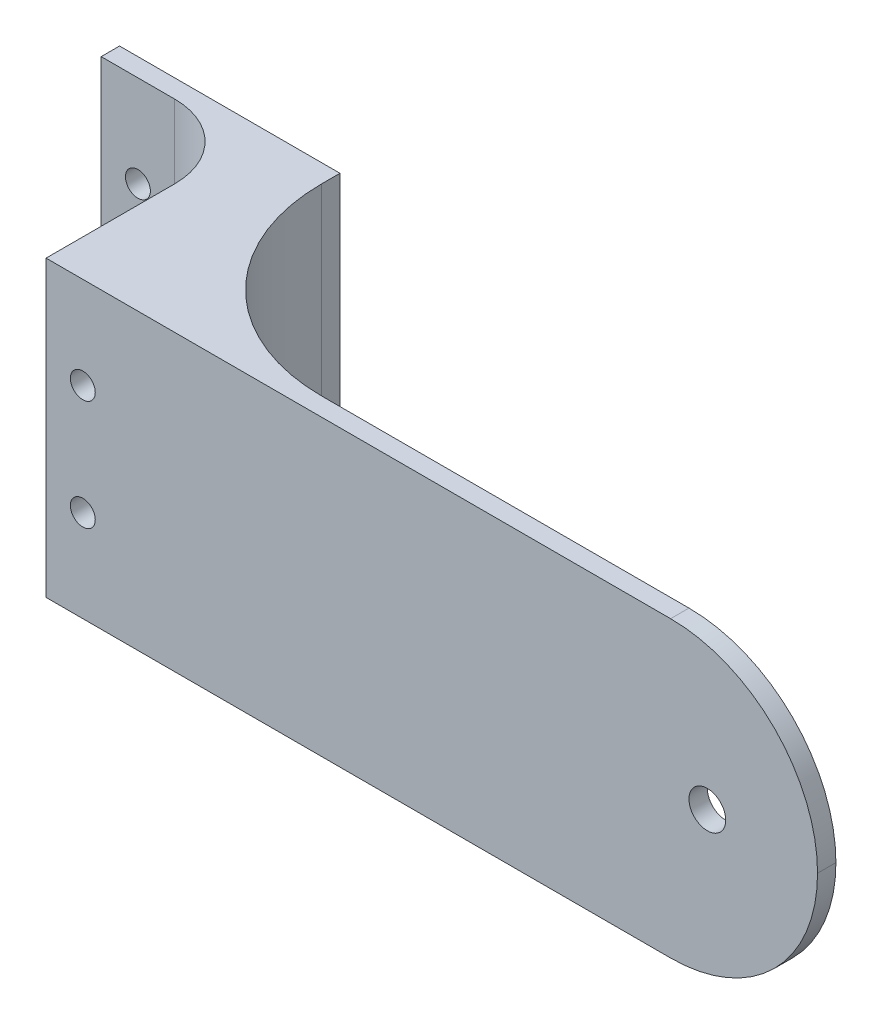
ISO-10303-21;
HEADER;
FILE_DESCRIPTION(('STEP AP214'),'2;1');
FILE_NAME('part.step','',(''),(''),'','','');
FILE_SCHEMA(('AUTOMOTIVE_DESIGN { 1 0 10303 214 1 1 1 1 }'));
ENDSEC;
DATA;
#1=APPLICATION_CONTEXT('core data for automotive mechanical design processes');
#2=APPLICATION_PROTOCOL_DEFINITION('international standard','automotive_design',2000,#1);
#3=PRODUCT_CONTEXT('',#1,'mechanical');
#4=PRODUCT('Part','Part','',(#3));
#5=PRODUCT_RELATED_PRODUCT_CATEGORY('part','',(#4));
#6=PRODUCT_DEFINITION_FORMATION('','',#4);
#7=PRODUCT_DEFINITION_CONTEXT('part definition',#1,'design');
#8=PRODUCT_DEFINITION('design','',#6,#7);
#9=PRODUCT_DEFINITION_SHAPE('','',#8);
#10=(LENGTH_UNIT() NAMED_UNIT(*) SI_UNIT(.MILLI.,.METRE.));
#11=(NAMED_UNIT(*) PLANE_ANGLE_UNIT() SI_UNIT($,.RADIAN.));
#12=(NAMED_UNIT(*) SI_UNIT($,.STERADIAN.) SOLID_ANGLE_UNIT());
#13=UNCERTAINTY_MEASURE_WITH_UNIT(LENGTH_MEASURE(1.E-05),#10,'distance_accuracy_value','');
#14=(GEOMETRIC_REPRESENTATION_CONTEXT(3) GLOBAL_UNCERTAINTY_ASSIGNED_CONTEXT((#13)) GLOBAL_UNIT_ASSIGNED_CONTEXT((#10,
#11,#12)) REPRESENTATION_CONTEXT('',''));
#15=CARTESIAN_POINT('',(0.,0.,0.));
#16=DIRECTION('',(0.,0.,1.));
#17=DIRECTION('',(1.,0.,0.));
#18=AXIS2_PLACEMENT_3D('',#15,#16,#17);
#19=CARTESIAN_POINT('',(0.,0.,19.05));
#20=DIRECTION('',(0.,0.,1.));
#21=DIRECTION('',(1.,0.,0.));
#22=AXIS2_PLACEMENT_3D('',#19,#20,#21);
#23=PLANE('',#22);
#24=CARTESIAN_POINT('',(-31.75,9.52500000000002,19.05));
#25=DIRECTION('',(0.,0.,1.));
#26=DIRECTION('',(1.,0.,0.));
#27=AXIS2_PLACEMENT_3D('',#24,#25,#26);
#28=CIRCLE('',#27,2.15265);
#29=CARTESIAN_POINT('',(-29.59735,9.52500000000002,19.05));
#30=VERTEX_POINT('',#29);
#31=EDGE_CURVE('E141',#30,#30,#28,.T.);
#32=ORIENTED_EDGE('',*,*,#31,.F.);
#33=EDGE_LOOP('',(#32));
#34=FACE_BOUND('',#33,.T.);
#35=CARTESIAN_POINT('',(-31.75,-9.52500000000003,19.05));
#36=DIRECTION('',(0.,0.,1.));
#37=DIRECTION('',(1.,0.,0.));
#38=AXIS2_PLACEMENT_3D('',#35,#36,#37);
#39=CIRCLE('',#38,2.15265);
#40=CARTESIAN_POINT('',(-29.59735,-9.52500000000003,19.05));
#41=VERTEX_POINT('',#40);
#42=EDGE_CURVE('E235',#41,#41,#39,.T.);
#43=ORIENTED_EDGE('',*,*,#42,.F.);
#44=EDGE_LOOP('',(#43));
#45=FACE_BOUND('',#44,.T.);
#46=DIRECTION('',(1.,0.,0.));
#47=VECTOR('',#46,1.);
#48=CARTESIAN_POINT('',(-38.1,-25.4,19.05));
#49=LINE('',#48,#47);
#50=CARTESIAN_POINT('',(-38.1,-25.4,19.05));
#51=VERTEX_POINT('',#50);
#52=CARTESIAN_POINT('',(-25.4,-25.4,19.05));
#53=VERTEX_POINT('',#52);
#54=EDGE_CURVE('E150',#51,#53,#49,.T.);
#55=ORIENTED_EDGE('',*,*,#54,.T.);
#56=DIRECTION('',(0.,1.,0.));
#57=VECTOR('',#56,1.);
#58=CARTESIAN_POINT('',(-25.4,25.4,19.05));
#59=LINE('',#58,#57);
#60=CARTESIAN_POINT('',(-25.4,25.4,19.05));
#61=VERTEX_POINT('',#60);
#62=EDGE_CURVE('E172',#53,#61,#59,.T.);
#63=ORIENTED_EDGE('',*,*,#62,.T.);
#64=DIRECTION('',(-1.,0.,0.));
#65=VECTOR('',#64,1.);
#66=CARTESIAN_POINT('',(0.,25.4,19.05));
#67=LINE('',#66,#65);
#68=CARTESIAN_POINT('',(-38.1,25.4,19.05));
#69=VERTEX_POINT('',#68);
#70=EDGE_CURVE('E145',#61,#69,#67,.T.);
#71=ORIENTED_EDGE('',*,*,#70,.T.);
#72=DIRECTION('',(0.,-1.,0.));
#73=VECTOR('',#72,1.);
#74=CARTESIAN_POINT('',(-38.1,25.4,19.05));
#75=LINE('',#74,#73);
#76=EDGE_CURVE('E147',#69,#51,#75,.T.);
#77=ORIENTED_EDGE('',*,*,#76,.T.);
#78=EDGE_LOOP('',(#55,#63,#71,#77));
#79=FACE_BOUND('',#78,.T.);
#80=ADVANCED_FACE('F34',(#34,#45,#79),#23,.T.);
#81=CARTESIAN_POINT('',(0.,-25.4,19.05));
#82=DIRECTION('',(-1.,0.,0.));
#83=DIRECTION('',(0.,-1.,0.));
#84=AXIS2_PLACEMENT_3D('',#81,#82,#83);
#85=PLANE('',#84);
#86=DIRECTION('',(0.,0.,-1.));
#87=VECTOR('',#86,1.);
#88=CARTESIAN_POINT('',(0.,25.4,19.05));
#89=LINE('',#88,#87);
#90=CARTESIAN_POINT('',(0.,25.4,19.05));
#91=VERTEX_POINT('',#90);
#92=CARTESIAN_POINT('',(0.,25.4,15.875));
#93=VERTEX_POINT('',#92);
#94=EDGE_CURVE('E170',#91,#93,#89,.T.);
#95=ORIENTED_EDGE('',*,*,#94,.F.);
#96=DIRECTION('',(0.,1.,0.));
#97=VECTOR('',#96,1.);
#98=CARTESIAN_POINT('',(0.,-25.4,19.05));
#99=LINE('',#98,#97);
#100=CARTESIAN_POINT('',(0.,-25.4,19.05));
#101=VERTEX_POINT('',#100);
#102=EDGE_CURVE('E183',#91,#101,#99,.F.);
#103=ORIENTED_EDGE('',*,*,#102,.T.);
#104=DIRECTION('',(0.,0.,-1.));
#105=VECTOR('',#104,1.);
#106=CARTESIAN_POINT('',(0.,-25.4,19.05));
#107=LINE('',#106,#105);
#108=CARTESIAN_POINT('',(0.,-25.4,15.875));
#109=VERTEX_POINT('',#108);
#110=EDGE_CURVE('E153',#101,#109,#107,.T.);
#111=ORIENTED_EDGE('',*,*,#110,.T.);
#112=DIRECTION('',(0.,1.,0.));
#113=VECTOR('',#112,1.);
#114=CARTESIAN_POINT('',(0.,-25.4,15.875));
#115=LINE('',#114,#113);
#116=EDGE_CURVE('E143',#109,#93,#115,.T.);
#117=ORIENTED_EDGE('',*,*,#116,.T.);
#118=EDGE_LOOP('',(#95,#103,#111,#117));
#119=FACE_BOUND('',#118,.T.);
#120=ADVANCED_FACE('F245',(#119),#85,.F.);
#121=CARTESIAN_POINT('',(0.,25.4,19.05));
#122=DIRECTION('',(0.,-1.,0.));
#123=DIRECTION('',(0.,0.,-1.));
#124=AXIS2_PLACEMENT_3D('',#121,#122,#123);
#125=PLANE('',#124);
#126=DIRECTION('',(-1.,0.,0.));
#127=VECTOR('',#126,1.);
#128=CARTESIAN_POINT('',(-12.7,25.4,53.975));
#129=LINE('',#128,#127);
#130=CARTESIAN_POINT('',(95.25,25.4,53.975));
#131=VERTEX_POINT('',#130);
#132=CARTESIAN_POINT('',(-12.7,25.4,53.975));
#133=VERTEX_POINT('',#132);
#134=EDGE_CURVE('E112',#131,#133,#129,.T.);
#135=ORIENTED_EDGE('',*,*,#134,.F.);
#136=DIRECTION('',(0.,0.,-1.));
#137=VECTOR('',#136,1.);
#138=CARTESIAN_POINT('',(95.25,25.4,19.05));
#139=LINE('',#138,#137);
#140=CARTESIAN_POINT('',(95.25,25.4,50.8));
#141=VERTEX_POINT('',#140);
#142=EDGE_CURVE('E12',#131,#141,#139,.T.);
#143=ORIENTED_EDGE('',*,*,#142,.T.);
#144=DIRECTION('',(-1.,0.,0.));
#145=VECTOR('',#144,1.);
#146=CARTESIAN_POINT('',(0.,25.4,50.8));
#147=LINE('',#146,#145);
#148=CARTESIAN_POINT('',(31.75,25.4,50.8));
#149=VERTEX_POINT('',#148);
#150=EDGE_CURVE('E120',#141,#149,#147,.T.);
#151=ORIENTED_EDGE('',*,*,#150,.T.);
#152=CARTESIAN_POINT('',(31.75,25.4,19.05));
#153=DIRECTION('',(0.,-1.,0.));
#154=DIRECTION('',(0.,0.,-1.));
#155=AXIS2_PLACEMENT_3D('',#152,#153,#154);
#156=CIRCLE('',#155,31.75);
#157=EDGE_CURVE('E185',#149,#91,#156,.T.);
#158=ORIENTED_EDGE('',*,*,#157,.T.);
#159=ORIENTED_EDGE('',*,*,#94,.T.);
#160=DIRECTION('',(-1.,0.,0.));
#161=VECTOR('',#160,1.);
#162=CARTESIAN_POINT('',(0.,25.4,15.875));
#163=LINE('',#162,#161);
#164=CARTESIAN_POINT('',(-38.1,25.4,15.875));
#165=VERTEX_POINT('',#164);
#166=EDGE_CURVE('E156',#93,#165,#163,.T.);
#167=ORIENTED_EDGE('',*,*,#166,.T.);
#168=DIRECTION('',(0.,0.,-1.));
#169=VECTOR('',#168,1.);
#170=CARTESIAN_POINT('',(-38.1,25.4,19.05));
#171=LINE('',#170,#169);
#172=EDGE_CURVE('E167',#69,#165,#171,.T.);
#173=ORIENTED_EDGE('',*,*,#172,.F.);
#174=ORIENTED_EDGE('',*,*,#70,.F.);
#175=CARTESIAN_POINT('',(-25.4,25.4,31.75));
#176=DIRECTION('',(0.,-1.,0.));
#177=DIRECTION('',(0.,0.,-1.));
#178=AXIS2_PLACEMENT_3D('',#175,#176,#177);
#179=CIRCLE('',#178,12.7);
#180=CARTESIAN_POINT('',(-12.7,25.4,31.75));
#181=VERTEX_POINT('',#180);
#182=EDGE_CURVE('E126',#61,#181,#179,.T.);
#183=ORIENTED_EDGE('',*,*,#182,.T.);
#184=DIRECTION('',(0.,0.,1.));
#185=VECTOR('',#184,1.);
#186=CARTESIAN_POINT('',(-12.7,25.4,-33.3134414453443));
#187=LINE('',#186,#185);
#188=EDGE_CURVE('E123',#181,#133,#187,.T.);
#189=ORIENTED_EDGE('',*,*,#188,.T.);
#190=EDGE_LOOP('',(#135,#143,#151,#158,#159,#167,#173,#174,#183,#189));
#191=FACE_BOUND('',#190,.T.);
#192=ADVANCED_FACE('F124',(#191),#125,.F.);
#193=CARTESIAN_POINT('',(-38.1,25.4,19.05));
#194=DIRECTION('',(1.,0.,0.));
#195=DIRECTION('',(0.,1.,0.));
#196=AXIS2_PLACEMENT_3D('',#193,#194,#195);
#197=PLANE('',#196);
#198=DIRECTION('',(0.,-1.,0.));
#199=VECTOR('',#198,1.);
#200=CARTESIAN_POINT('',(-38.1,25.4,15.875));
#201=LINE('',#200,#199);
#202=CARTESIAN_POINT('',(-38.1,-25.4,15.875));
#203=VERTEX_POINT('',#202);
#204=EDGE_CURVE('E158',#165,#203,#201,.T.);
#205=ORIENTED_EDGE('',*,*,#204,.T.);
#206=DIRECTION('',(0.,0.,-1.));
#207=VECTOR('',#206,1.);
#208=CARTESIAN_POINT('',(-38.1,-25.4,19.05));
#209=LINE('',#208,#207);
#210=EDGE_CURVE('E164',#51,#203,#209,.T.);
#211=ORIENTED_EDGE('',*,*,#210,.F.);
#212=ORIENTED_EDGE('',*,*,#76,.F.);
#213=ORIENTED_EDGE('',*,*,#172,.T.);
#214=EDGE_LOOP('',(#205,#211,#212,#213));
#215=FACE_BOUND('',#214,.T.);
#216=ADVANCED_FACE('F302',(#215),#197,.F.);
#217=CARTESIAN_POINT('',(-25.4,-25.4,19.05));
#218=DIRECTION('',(0.,1.,0.));
#219=DIRECTION('',(-1.,0.,0.));
#220=AXIS2_PLACEMENT_3D('',#217,#218,#219);
#221=PLANE('',#220);
#222=DIRECTION('',(1.,0.,0.));
#223=VECTOR('',#222,1.);
#224=CARTESIAN_POINT('',(120.65,-25.4,50.8));
#225=LINE('',#224,#223);
#226=CARTESIAN_POINT('',(31.75,-25.4,50.8));
#227=VERTEX_POINT('',#226);
#228=CARTESIAN_POINT('',(95.25,-25.4,50.8));
#229=VERTEX_POINT('',#228);
#230=EDGE_CURVE('E138',#227,#229,#225,.T.);
#231=ORIENTED_EDGE('',*,*,#230,.T.);
#232=DIRECTION('',(0.,0.,-1.));
#233=VECTOR('',#232,1.);
#234=CARTESIAN_POINT('',(95.25,-25.4,19.05));
#235=LINE('',#234,#233);
#236=CARTESIAN_POINT('',(95.25,-25.3999999999999,53.975));
#237=VERTEX_POINT('',#236);
#238=EDGE_CURVE('E193',#229,#237,#235,.F.);
#239=ORIENTED_EDGE('',*,*,#238,.T.);
#240=DIRECTION('',(1.,0.,0.));
#241=VECTOR('',#240,1.);
#242=CARTESIAN_POINT('',(0.,-25.4,53.975));
#243=LINE('',#242,#241);
#244=CARTESIAN_POINT('',(-12.7,-25.4,53.975));
#245=VERTEX_POINT('',#244);
#246=EDGE_CURVE('E130',#245,#237,#243,.T.);
#247=ORIENTED_EDGE('',*,*,#246,.F.);
#248=DIRECTION('',(0.,0.,1.));
#249=VECTOR('',#248,1.);
#250=CARTESIAN_POINT('',(-12.7,-25.4,-33.3134414453443));
#251=LINE('',#250,#249);
#252=CARTESIAN_POINT('',(-12.7,-25.4,31.75));
#253=VERTEX_POINT('',#252);
#254=EDGE_CURVE('E129',#253,#245,#251,.T.);
#255=ORIENTED_EDGE('',*,*,#254,.F.);
#256=CARTESIAN_POINT('',(-25.4,-25.4,31.75));
#257=DIRECTION('',(0.,1.,0.));
#258=DIRECTION('',(-1.,0.,0.));
#259=AXIS2_PLACEMENT_3D('',#256,#257,#258);
#260=CIRCLE('',#259,12.7);
#261=EDGE_CURVE('E178',#253,#53,#260,.T.);
#262=ORIENTED_EDGE('',*,*,#261,.T.);
#263=ORIENTED_EDGE('',*,*,#54,.F.);
#264=ORIENTED_EDGE('',*,*,#210,.T.);
#265=DIRECTION('',(1.,0.,0.));
#266=VECTOR('',#265,1.);
#267=CARTESIAN_POINT('',(-25.4,-25.4,15.875));
#268=LINE('',#267,#266);
#269=EDGE_CURVE('E148',#203,#109,#268,.T.);
#270=ORIENTED_EDGE('',*,*,#269,.T.);
#271=ORIENTED_EDGE('',*,*,#110,.F.);
#272=CARTESIAN_POINT('',(31.75,-25.4,19.05));
#273=DIRECTION('',(0.,1.,0.));
#274=DIRECTION('',(-1.,0.,0.));
#275=AXIS2_PLACEMENT_3D('',#272,#273,#274);
#276=CIRCLE('',#275,31.75);
#277=EDGE_CURVE('E187',#101,#227,#276,.T.);
#278=ORIENTED_EDGE('',*,*,#277,.T.);
#279=EDGE_LOOP('',(#231,#239,#247,#255,#262,#263,#264,#270,#271,#278));
#280=FACE_BOUND('',#279,.T.);
#281=ADVANCED_FACE('F199',(#280),#221,.F.);
#282=CARTESIAN_POINT('',(0.,0.,15.875));
#283=DIRECTION('',(0.,0.,1.));
#284=DIRECTION('',(1.,0.,0.));
#285=AXIS2_PLACEMENT_3D('',#282,#283,#284);
#286=PLANE('',#285);
#287=CARTESIAN_POINT('',(-31.75,9.52500000000002,15.875));
#288=DIRECTION('',(0.,0.,1.));
#289=DIRECTION('',(1.,0.,0.));
#290=AXIS2_PLACEMENT_3D('',#287,#288,#289);
#291=CIRCLE('',#290,2.15265);
#292=CARTESIAN_POINT('',(-29.59735,9.52500000000002,15.875));
#293=VERTEX_POINT('',#292);
#294=EDGE_CURVE('E221',#293,#293,#291,.F.);
#295=ORIENTED_EDGE('',*,*,#294,.F.);
#296=EDGE_LOOP('',(#295));
#297=FACE_BOUND('',#296,.T.);
#298=CARTESIAN_POINT('',(-6.34999999999999,-9.52500000000002,15.875));
#299=DIRECTION('',(0.,0.,1.));
#300=DIRECTION('',(1.,0.,0.));
#301=AXIS2_PLACEMENT_3D('',#298,#299,#300);
#302=CIRCLE('',#301,2.15265);
#303=CARTESIAN_POINT('',(-4.19734999999999,-9.52500000000002,15.875));
#304=VERTEX_POINT('',#303);
#305=EDGE_CURVE('E225',#304,#304,#302,.F.);
#306=ORIENTED_EDGE('',*,*,#305,.F.);
#307=EDGE_LOOP('',(#306));
#308=FACE_BOUND('',#307,.T.);
#309=CARTESIAN_POINT('',(-31.75,-9.52500000000003,15.875));
#310=DIRECTION('',(0.,0.,1.));
#311=DIRECTION('',(1.,0.,0.));
#312=AXIS2_PLACEMENT_3D('',#309,#310,#311);
#313=CIRCLE('',#312,2.15265);
#314=CARTESIAN_POINT('',(-29.59735,-9.52500000000003,15.875));
#315=VERTEX_POINT('',#314);
#316=EDGE_CURVE('E208',#315,#315,#313,.F.);
#317=ORIENTED_EDGE('',*,*,#316,.F.);
#318=EDGE_LOOP('',(#317));
#319=FACE_BOUND('',#318,.T.);
#320=CARTESIAN_POINT('',(-6.34999999999999,9.52500000000002,15.875));
#321=DIRECTION('',(0.,0.,1.));
#322=DIRECTION('',(1.,0.,0.));
#323=AXIS2_PLACEMENT_3D('',#320,#321,#322);
#324=CIRCLE('',#323,2.15265);
#325=CARTESIAN_POINT('',(-4.19734999999999,9.52500000000002,15.875));
#326=VERTEX_POINT('',#325);
#327=EDGE_CURVE('E232',#326,#326,#324,.F.);
#328=ORIENTED_EDGE('',*,*,#327,.F.);
#329=EDGE_LOOP('',(#328));
#330=FACE_BOUND('',#329,.T.);
#331=ORIENTED_EDGE('',*,*,#116,.F.);
#332=ORIENTED_EDGE('',*,*,#269,.F.);
#333=ORIENTED_EDGE('',*,*,#204,.F.);
#334=ORIENTED_EDGE('',*,*,#166,.F.);
#335=EDGE_LOOP('',(#331,#332,#333,#334));
#336=FACE_BOUND('',#335,.T.);
#337=ADVANCED_FACE('F265',(#297,#308,#319,#330,#336),#286,.F.);
#338=CARTESIAN_POINT('',(-12.7,25.4,-33.3134414453443));
#339=DIRECTION('',(-1.,0.,0.));
#340=DIRECTION('',(0.,-1.,0.));
#341=AXIS2_PLACEMENT_3D('',#338,#339,#340);
#342=PLANE('',#341);
#343=ORIENTED_EDGE('',*,*,#188,.F.);
#344=DIRECTION('',(0.,1.,0.));
#345=VECTOR('',#344,1.);
#346=CARTESIAN_POINT('',(-12.7,-25.4,31.75));
#347=LINE('',#346,#345);
#348=EDGE_CURVE('E175',#181,#253,#347,.F.);
#349=ORIENTED_EDGE('',*,*,#348,.T.);
#350=ORIENTED_EDGE('',*,*,#254,.T.);
#351=DIRECTION('',(0.,-1.,0.));
#352=VECTOR('',#351,1.);
#353=CARTESIAN_POINT('',(-12.7,-25.4,53.975));
#354=LINE('',#353,#352);
#355=EDGE_CURVE('E116',#133,#245,#354,.T.);
#356=ORIENTED_EDGE('',*,*,#355,.F.);
#357=EDGE_LOOP('',(#343,#349,#350,#356));
#358=FACE_BOUND('',#357,.T.);
#359=ADVANCED_FACE('F132',(#358),#342,.T.);
#360=CARTESIAN_POINT('',(-25.4,0.,31.75));
#361=DIRECTION('',(0.,-1.,0.));
#362=DIRECTION('',(1.,0.,0.));
#363=AXIS2_PLACEMENT_3D('',#360,#361,#362);
#364=CYLINDRICAL_SURFACE('',#363,12.7);
#365=ORIENTED_EDGE('',*,*,#261,.F.);
#366=ORIENTED_EDGE('',*,*,#348,.F.);
#367=ORIENTED_EDGE('',*,*,#182,.F.);
#368=ORIENTED_EDGE('',*,*,#62,.F.);
#369=EDGE_LOOP('',(#365,#366,#367,#368));
#370=FACE_BOUND('',#369,.T.);
#371=ADVANCED_FACE('F255',(#370),#364,.F.);
#372=CARTESIAN_POINT('',(0.,0.,53.975));
#373=DIRECTION('',(0.,0.,-1.));
#374=DIRECTION('',(-1.,0.,0.));
#375=AXIS2_PLACEMENT_3D('',#372,#373,#374);
#376=PLANE('',#375);
#377=CARTESIAN_POINT('',(101.6,0.,53.975));
#378=DIRECTION('',(0.,0.,1.));
#379=DIRECTION('',(1.,0.,0.));
#380=AXIS2_PLACEMENT_3D('',#377,#378,#379);
#381=CIRCLE('',#380,3.175);
#382=CARTESIAN_POINT('',(104.775,0.,53.975));
#383=VERTEX_POINT('',#382);
#384=EDGE_CURVE('E209',#383,#383,#381,.T.);
#385=ORIENTED_EDGE('',*,*,#384,.F.);
#386=EDGE_LOOP('',(#385));
#387=FACE_BOUND('',#386,.T.);
#388=CARTESIAN_POINT('',(-6.34999999999999,-9.52500000000002,53.975));
#389=DIRECTION('',(0.,0.,1.));
#390=DIRECTION('',(-1.,0.,0.));
#391=AXIS2_PLACEMENT_3D('',#388,#389,#390);
#392=CIRCLE('',#391,2.15265);
#393=CARTESIAN_POINT('',(-4.19734999999999,-9.52500000000002,53.975));
#394=VERTEX_POINT('',#393);
#395=EDGE_CURVE('E211',#394,#394,#392,.T.);
#396=ORIENTED_EDGE('',*,*,#395,.F.);
#397=EDGE_LOOP('',(#396));
#398=FACE_BOUND('',#397,.T.);
#399=CARTESIAN_POINT('',(-6.34999999999999,9.52500000000002,53.975));
#400=DIRECTION('',(0.,0.,1.));
#401=DIRECTION('',(1.,0.,0.));
#402=AXIS2_PLACEMENT_3D('',#399,#400,#401);
#403=CIRCLE('',#402,2.15265);
#404=CARTESIAN_POINT('',(-4.19734999999999,9.52500000000002,53.975));
#405=VERTEX_POINT('',#404);
#406=EDGE_CURVE('E224',#405,#405,#403,.T.);
#407=ORIENTED_EDGE('',*,*,#406,.F.);
#408=EDGE_LOOP('',(#407));
#409=FACE_BOUND('',#408,.T.);
#410=ORIENTED_EDGE('',*,*,#246,.T.);
#411=CARTESIAN_POINT('',(95.25,0.,53.975));
#412=DIRECTION('',(0.,0.,-1.));
#413=DIRECTION('',(-1.,0.,0.));
#414=AXIS2_PLACEMENT_3D('',#411,#412,#413);
#415=CIRCLE('',#414,25.4);
#416=CARTESIAN_POINT('',(120.65,0.,53.975));
#417=VERTEX_POINT('',#416);
#418=EDGE_CURVE('E43',#237,#417,#415,.F.);
#419=ORIENTED_EDGE('',*,*,#418,.T.);
#420=CARTESIAN_POINT('',(95.25,0.,53.975));
#421=DIRECTION('',(0.,0.,-1.));
#422=DIRECTION('',(-1.,0.,0.));
#423=AXIS2_PLACEMENT_3D('',#420,#421,#422);
#424=CIRCLE('',#423,25.4);
#425=EDGE_CURVE('E53',#417,#131,#424,.F.);
#426=ORIENTED_EDGE('',*,*,#425,.T.);
#427=ORIENTED_EDGE('',*,*,#134,.T.);
#428=ORIENTED_EDGE('',*,*,#355,.T.);
#429=EDGE_LOOP('',(#410,#419,#426,#427,#428));
#430=FACE_BOUND('',#429,.T.);
#431=ADVANCED_FACE('F114',(#387,#398,#409,#430),#376,.F.);
#432=CARTESIAN_POINT('',(0.,0.,50.8));
#433=DIRECTION('',(0.,0.,-1.));
#434=DIRECTION('',(-1.,0.,0.));
#435=AXIS2_PLACEMENT_3D('',#432,#433,#434);
#436=PLANE('',#435);
#437=CARTESIAN_POINT('',(101.6,0.,50.8));
#438=DIRECTION('',(0.,0.,-1.));
#439=DIRECTION('',(-1.,0.,0.));
#440=AXIS2_PLACEMENT_3D('',#437,#438,#439);
#441=CIRCLE('',#440,3.175);
#442=CARTESIAN_POINT('',(98.425,0.,50.8));
#443=VERTEX_POINT('',#442);
#444=EDGE_CURVE('E214',#443,#443,#441,.F.);
#445=ORIENTED_EDGE('',*,*,#444,.T.);
#446=EDGE_LOOP('',(#445));
#447=FACE_BOUND('',#446,.T.);
#448=CARTESIAN_POINT('',(95.25,0.,50.8));
#449=DIRECTION('',(0.,0.,-1.));
#450=DIRECTION('',(-1.,0.,0.));
#451=AXIS2_PLACEMENT_3D('',#448,#449,#450);
#452=CIRCLE('',#451,25.4);
#453=CARTESIAN_POINT('',(120.65,0.,50.8));
#454=VERTEX_POINT('',#453);
#455=EDGE_CURVE('E189',#141,#454,#452,.T.);
#456=ORIENTED_EDGE('',*,*,#455,.T.);
#457=CARTESIAN_POINT('',(95.25,0.,50.8));
#458=DIRECTION('',(0.,0.,-1.));
#459=DIRECTION('',(-1.,0.,0.));
#460=AXIS2_PLACEMENT_3D('',#457,#458,#459);
#461=CIRCLE('',#460,25.4);
#462=EDGE_CURVE('E191',#454,#229,#461,.T.);
#463=ORIENTED_EDGE('',*,*,#462,.T.);
#464=ORIENTED_EDGE('',*,*,#230,.F.);
#465=DIRECTION('',(0.,1.,0.));
#466=VECTOR('',#465,1.);
#467=CARTESIAN_POINT('',(31.75,0.,50.8));
#468=LINE('',#467,#466);
#469=EDGE_CURVE('E180',#227,#149,#468,.T.);
#470=ORIENTED_EDGE('',*,*,#469,.T.);
#471=ORIENTED_EDGE('',*,*,#150,.F.);
#472=EDGE_LOOP('',(#456,#463,#464,#470,#471));
#473=FACE_BOUND('',#472,.T.);
#474=ADVANCED_FACE('F262',(#447,#473),#436,.T.);
#475=CARTESIAN_POINT('',(31.75,0.,19.05));
#476=DIRECTION('',(0.,1.,0.));
#477=DIRECTION('',(-1.,0.,0.));
#478=AXIS2_PLACEMENT_3D('',#475,#476,#477);
#479=CYLINDRICAL_SURFACE('',#478,31.75);
#480=ORIENTED_EDGE('',*,*,#277,.F.);
#481=ORIENTED_EDGE('',*,*,#102,.F.);
#482=ORIENTED_EDGE('',*,*,#157,.F.);
#483=ORIENTED_EDGE('',*,*,#469,.F.);
#484=EDGE_LOOP('',(#480,#481,#482,#483));
#485=FACE_BOUND('',#484,.T.);
#486=ADVANCED_FACE('F270',(#485),#479,.F.);
#487=CARTESIAN_POINT('',(-6.34999999999999,9.52500000000002,9.78638634991511));
#488=DIRECTION('',(0.,0.,1.));
#489=DIRECTION('',(1.,0.,0.));
#490=AXIS2_PLACEMENT_3D('',#487,#488,#489);
#491=CYLINDRICAL_SURFACE('',#490,2.15265);
#492=CARTESIAN_POINT('',(-4.19734999999999,9.52500000000002,15.875));
#493=CARTESIAN_POINT('',(-4.19734999999999,9.52500000000002,16.271875));
#494=CARTESIAN_POINT('',(-4.19734999999999,9.52500000000002,16.66875));
#495=CARTESIAN_POINT('',(-4.19734999999999,9.52500000000002,17.4625));
#496=CARTESIAN_POINT('',(-4.19734999999999,9.52500000000002,17.859375));
#497=CARTESIAN_POINT('',(-4.19734999999999,9.52500000000002,18.653125));
#498=CARTESIAN_POINT('',(-4.19734999999999,9.52500000000002,19.05));
#499=CARTESIAN_POINT('',(-4.19734999999999,9.52500000000002,19.84375));
#500=CARTESIAN_POINT('',(-4.19734999999999,9.52500000000002,20.240625));
#501=CARTESIAN_POINT('',(-4.19734999999999,9.52500000000002,21.034375));
#502=CARTESIAN_POINT('',(-4.19734999999999,9.52500000000002,21.43125));
#503=CARTESIAN_POINT('',(-4.19734999999999,9.52500000000002,22.225));
#504=CARTESIAN_POINT('',(-4.19734999999999,9.52500000000002,22.621875));
#505=CARTESIAN_POINT('',(-4.19734999999999,9.52500000000002,23.415625));
#506=CARTESIAN_POINT('',(-4.19734999999999,9.52500000000002,23.8125));
#507=CARTESIAN_POINT('',(-4.19734999999999,9.52500000000002,24.60625));
#508=CARTESIAN_POINT('',(-4.19734999999999,9.52500000000002,25.003125));
#509=CARTESIAN_POINT('',(-4.19734999999999,9.52500000000002,25.796875));
#510=CARTESIAN_POINT('',(-4.19734999999999,9.52500000000002,26.19375));
#511=CARTESIAN_POINT('',(-4.19734999999999,9.52500000000002,26.9875));
#512=CARTESIAN_POINT('',(-4.19734999999999,9.52500000000002,27.384375));
#513=CARTESIAN_POINT('',(-4.19734999999999,9.52500000000002,28.178125));
#514=CARTESIAN_POINT('',(-4.19734999999999,9.52500000000002,28.575));
#515=CARTESIAN_POINT('',(-4.19734999999999,9.52500000000002,29.36875));
#516=CARTESIAN_POINT('',(-4.19734999999999,9.52500000000002,29.765625));
#517=CARTESIAN_POINT('',(-4.19734999999999,9.52500000000002,30.559375));
#518=CARTESIAN_POINT('',(-4.19734999999999,9.52500000000002,30.95625));
#519=CARTESIAN_POINT('',(-4.19734999999999,9.52500000000002,31.75));
#520=CARTESIAN_POINT('',(-4.19734999999999,9.52500000000002,32.146875));
#521=CARTESIAN_POINT('',(-4.19734999999999,9.52500000000002,32.940625));
#522=CARTESIAN_POINT('',(-4.19734999999999,9.52500000000002,33.3375));
#523=CARTESIAN_POINT('',(-4.19734999999999,9.52500000000002,34.13125));
#524=CARTESIAN_POINT('',(-4.19734999999999,9.52500000000002,34.528125));
#525=CARTESIAN_POINT('',(-4.19734999999999,9.52500000000002,35.321875));
#526=CARTESIAN_POINT('',(-4.19734999999999,9.52500000000002,35.71875));
#527=CARTESIAN_POINT('',(-4.19734999999999,9.52500000000002,36.5125));
#528=CARTESIAN_POINT('',(-4.19734999999999,9.52500000000002,36.909375));
#529=CARTESIAN_POINT('',(-4.19734999999999,9.52500000000002,37.703125));
#530=CARTESIAN_POINT('',(-4.19734999999999,9.52500000000002,38.1));
#531=CARTESIAN_POINT('',(-4.19734999999999,9.52500000000002,38.89375));
#532=CARTESIAN_POINT('',(-4.19734999999999,9.52500000000002,39.290625));
#533=CARTESIAN_POINT('',(-4.19734999999999,9.52500000000002,40.084375));
#534=CARTESIAN_POINT('',(-4.19734999999999,9.52500000000002,40.48125));
#535=CARTESIAN_POINT('',(-4.19734999999999,9.52500000000002,41.275));
#536=CARTESIAN_POINT('',(-4.19734999999999,9.52500000000002,41.671875));
#537=CARTESIAN_POINT('',(-4.19734999999999,9.52500000000002,42.465625));
#538=CARTESIAN_POINT('',(-4.19734999999999,9.52500000000002,42.8625));
#539=CARTESIAN_POINT('',(-4.19734999999999,9.52500000000002,43.65625));
#540=CARTESIAN_POINT('',(-4.19734999999999,9.52500000000002,44.053125));
#541=CARTESIAN_POINT('',(-4.19734999999999,9.52500000000002,44.846875));
#542=CARTESIAN_POINT('',(-4.19734999999999,9.52500000000002,45.24375));
#543=CARTESIAN_POINT('',(-4.19734999999999,9.52500000000002,46.0375));
#544=CARTESIAN_POINT('',(-4.19734999999999,9.52500000000002,46.434375));
#545=CARTESIAN_POINT('',(-4.19734999999999,9.52500000000002,47.228125));
#546=CARTESIAN_POINT('',(-4.19734999999999,9.52500000000002,47.625));
#547=CARTESIAN_POINT('',(-4.19734999999999,9.52500000000002,48.41875));
#548=CARTESIAN_POINT('',(-4.19734999999999,9.52500000000002,48.815625));
#549=CARTESIAN_POINT('',(-4.19734999999999,9.52500000000002,49.609375));
#550=CARTESIAN_POINT('',(-4.19734999999999,9.52500000000002,50.00625));
#551=CARTESIAN_POINT('',(-4.19734999999999,9.52500000000002,50.8));
#552=CARTESIAN_POINT('',(-4.19734999999999,9.52500000000002,51.196875));
#553=CARTESIAN_POINT('',(-4.19734999999999,9.52500000000002,51.990625));
#554=CARTESIAN_POINT('',(-4.19734999999999,9.52500000000002,52.3875));
#555=CARTESIAN_POINT('',(-4.19734999999999,9.52500000000002,53.18125));
#556=CARTESIAN_POINT('',(-4.19734999999999,9.52500000000002,53.578125));
#557=CARTESIAN_POINT('',(-4.19734999999999,9.52500000000002,53.975));
#558=B_SPLINE_CURVE_WITH_KNOTS('',3,(#492,#493,#494,#495,#496,#497,#498,#499,#500,#501,#502,
#503,#504,#505,#506,#507,#508,#509,#510,#511,#512,#513,#514,#515,#516,#517,#518,#519,#520,#521,
#522,#523,#524,#525,#526,#527,#528,#529,#530,#531,#532,#533,#534,#535,#536,#537,#538,#539,#540,
#541,#542,#543,#544,#545,#546,#547,#548,#549,#550,#551,#552,#553,#554,#555,#556,#557),
.UNSPECIFIED.,.F.,.F.,(4,2,2,2,2,2,2,2,2,2,2,2,2,2,2,2,2,2,2,2,2,2,2,2,2,2,2,2,2,2,2,2,4),(0.,
1.190625,2.38125,3.571875,4.7625,5.953125,7.14375,8.334375,9.525,10.715625,11.90625,13.096875,
14.2875,15.478125,16.66875,17.859375,19.05,20.240625,21.43125,22.621875,23.8125,25.003125,
26.19375,27.384375,28.575,29.765625,30.95625,32.146875,33.3375,34.528125,35.71875,36.909375,
38.1),.UNSPECIFIED.);
#559=EDGE_CURVE('BSEAM272',#326,#405,#558,.T.);
#560=ORIENTED_EDGE('',*,*,#327,.T.);
#561=ORIENTED_EDGE('',*,*,#406,.T.);
#562=ORIENTED_EDGE('',*,*,#559,.T.);
#563=ORIENTED_EDGE('',*,*,#559,.F.);
#564=EDGE_LOOP('',(#560,#562,#561,#563));
#565=FACE_BOUND('',#564,.T.);
#566=ADVANCED_FACE('F272',(#565),#491,.F.);
#567=CARTESIAN_POINT('',(-6.34999999999999,-9.52500000000002,9.78638634991511));
#568=DIRECTION('',(0.,0.,1.));
#569=DIRECTION('',(1.,0.,0.));
#570=AXIS2_PLACEMENT_3D('',#567,#568,#569);
#571=CYLINDRICAL_SURFACE('',#570,2.15265);
#572=CARTESIAN_POINT('',(-4.19734999999999,-9.52500000000002,15.875));
#573=CARTESIAN_POINT('',(-4.19734999999999,-9.52500000000002,16.271875));
#574=CARTESIAN_POINT('',(-4.19734999999999,-9.52500000000002,16.66875));
#575=CARTESIAN_POINT('',(-4.19734999999999,-9.52500000000002,17.4625));
#576=CARTESIAN_POINT('',(-4.19734999999999,-9.52500000000002,17.859375));
#577=CARTESIAN_POINT('',(-4.19734999999999,-9.52500000000002,18.653125));
#578=CARTESIAN_POINT('',(-4.19734999999999,-9.52500000000002,19.05));
#579=CARTESIAN_POINT('',(-4.19734999999999,-9.52500000000002,19.84375));
#580=CARTESIAN_POINT('',(-4.19734999999999,-9.52500000000002,20.240625));
#581=CARTESIAN_POINT('',(-4.19734999999999,-9.52500000000002,21.034375));
#582=CARTESIAN_POINT('',(-4.19734999999999,-9.52500000000002,21.43125));
#583=CARTESIAN_POINT('',(-4.19734999999999,-9.52500000000002,22.225));
#584=CARTESIAN_POINT('',(-4.19734999999999,-9.52500000000002,22.621875));
#585=CARTESIAN_POINT('',(-4.19734999999999,-9.52500000000002,23.415625));
#586=CARTESIAN_POINT('',(-4.19734999999999,-9.52500000000002,23.8125));
#587=CARTESIAN_POINT('',(-4.19734999999999,-9.52500000000002,24.60625));
#588=CARTESIAN_POINT('',(-4.19734999999999,-9.52500000000002,25.003125));
#589=CARTESIAN_POINT('',(-4.19734999999999,-9.52500000000002,25.796875));
#590=CARTESIAN_POINT('',(-4.19734999999999,-9.52500000000002,26.19375));
#591=CARTESIAN_POINT('',(-4.19734999999999,-9.52500000000002,26.9875));
#592=CARTESIAN_POINT('',(-4.19734999999999,-9.52500000000002,27.384375));
#593=CARTESIAN_POINT('',(-4.19734999999999,-9.52500000000002,28.178125));
#594=CARTESIAN_POINT('',(-4.19734999999999,-9.52500000000002,28.575));
#595=CARTESIAN_POINT('',(-4.19734999999999,-9.52500000000002,29.36875));
#596=CARTESIAN_POINT('',(-4.19734999999999,-9.52500000000002,29.765625));
#597=CARTESIAN_POINT('',(-4.19734999999999,-9.52500000000002,30.559375));
#598=CARTESIAN_POINT('',(-4.19734999999999,-9.52500000000002,30.95625));
#599=CARTESIAN_POINT('',(-4.19734999999999,-9.52500000000002,31.75));
#600=CARTESIAN_POINT('',(-4.19734999999999,-9.52500000000002,32.146875));
#601=CARTESIAN_POINT('',(-4.19734999999999,-9.52500000000002,32.940625));
#602=CARTESIAN_POINT('',(-4.19734999999999,-9.52500000000002,33.3375));
#603=CARTESIAN_POINT('',(-4.19734999999999,-9.52500000000002,34.13125));
#604=CARTESIAN_POINT('',(-4.19734999999999,-9.52500000000002,34.528125));
#605=CARTESIAN_POINT('',(-4.19734999999999,-9.52500000000002,35.321875));
#606=CARTESIAN_POINT('',(-4.19734999999999,-9.52500000000002,35.71875));
#607=CARTESIAN_POINT('',(-4.19734999999999,-9.52500000000002,36.5125));
#608=CARTESIAN_POINT('',(-4.19734999999999,-9.52500000000002,36.909375));
#609=CARTESIAN_POINT('',(-4.19734999999999,-9.52500000000002,37.703125));
#610=CARTESIAN_POINT('',(-4.19734999999999,-9.52500000000002,38.1));
#611=CARTESIAN_POINT('',(-4.19734999999999,-9.52500000000002,38.89375));
#612=CARTESIAN_POINT('',(-4.19734999999999,-9.52500000000002,39.290625));
#613=CARTESIAN_POINT('',(-4.19734999999999,-9.52500000000002,40.084375));
#614=CARTESIAN_POINT('',(-4.19734999999999,-9.52500000000002,40.48125));
#615=CARTESIAN_POINT('',(-4.19734999999999,-9.52500000000002,41.275));
#616=CARTESIAN_POINT('',(-4.19734999999999,-9.52500000000002,41.671875));
#617=CARTESIAN_POINT('',(-4.19734999999999,-9.52500000000002,42.465625));
#618=CARTESIAN_POINT('',(-4.19734999999999,-9.52500000000002,42.8625));
#619=CARTESIAN_POINT('',(-4.19734999999999,-9.52500000000002,43.65625));
#620=CARTESIAN_POINT('',(-4.19734999999999,-9.52500000000002,44.053125));
#621=CARTESIAN_POINT('',(-4.19734999999999,-9.52500000000002,44.846875));
#622=CARTESIAN_POINT('',(-4.19734999999999,-9.52500000000002,45.24375));
#623=CARTESIAN_POINT('',(-4.19734999999999,-9.52500000000002,46.0375));
#624=CARTESIAN_POINT('',(-4.19734999999999,-9.52500000000002,46.434375));
#625=CARTESIAN_POINT('',(-4.19734999999999,-9.52500000000002,47.228125));
#626=CARTESIAN_POINT('',(-4.19734999999999,-9.52500000000002,47.625));
#627=CARTESIAN_POINT('',(-4.19734999999999,-9.52500000000002,48.41875));
#628=CARTESIAN_POINT('',(-4.19734999999999,-9.52500000000002,48.815625));
#629=CARTESIAN_POINT('',(-4.19734999999999,-9.52500000000002,49.609375));
#630=CARTESIAN_POINT('',(-4.19734999999999,-9.52500000000002,50.00625));
#631=CARTESIAN_POINT('',(-4.19734999999999,-9.52500000000002,50.8));
#632=CARTESIAN_POINT('',(-4.19734999999999,-9.52500000000002,51.196875));
#633=CARTESIAN_POINT('',(-4.19734999999999,-9.52500000000002,51.990625));
#634=CARTESIAN_POINT('',(-4.19734999999999,-9.52500000000002,52.3875));
#635=CARTESIAN_POINT('',(-4.19734999999999,-9.52500000000002,53.18125));
#636=CARTESIAN_POINT('',(-4.19734999999999,-9.52500000000002,53.578125));
#637=CARTESIAN_POINT('',(-4.19734999999999,-9.52500000000002,53.975));
#638=B_SPLINE_CURVE_WITH_KNOTS('',3,(#572,#573,#574,#575,#576,#577,#578,#579,#580,#581,#582,
#583,#584,#585,#586,#587,#588,#589,#590,#591,#592,#593,#594,#595,#596,#597,#598,#599,#600,#601,
#602,#603,#604,#605,#606,#607,#608,#609,#610,#611,#612,#613,#614,#615,#616,#617,#618,#619,#620,
#621,#622,#623,#624,#625,#626,#627,#628,#629,#630,#631,#632,#633,#634,#635,#636,#637),
.UNSPECIFIED.,.F.,.F.,(4,2,2,2,2,2,2,2,2,2,2,2,2,2,2,2,2,2,2,2,2,2,2,2,2,2,2,2,2,2,2,2,4),(0.,
1.190625,2.38125,3.571875,4.7625,5.953125,7.14375,8.334375,9.525,10.715625,11.90625,13.096875,
14.2875,15.478125,16.66875,17.859375,19.05,20.240625,21.43125,22.621875,23.8125,25.003125,
26.19375,27.384375,28.575,29.765625,30.95625,32.146875,33.3375,34.528125,35.71875,36.909375,
38.1),.UNSPECIFIED.);
#639=EDGE_CURVE('BSEAM319',#304,#394,#638,.T.);
#640=ORIENTED_EDGE('',*,*,#305,.T.);
#641=ORIENTED_EDGE('',*,*,#395,.T.);
#642=ORIENTED_EDGE('',*,*,#639,.T.);
#643=ORIENTED_EDGE('',*,*,#639,.F.);
#644=EDGE_LOOP('',(#640,#642,#641,#643));
#645=FACE_BOUND('',#644,.T.);
#646=ADVANCED_FACE('F319',(#645),#571,.F.);
#647=CARTESIAN_POINT('',(-31.75,-9.52500000000003,9.78638634991511));
#648=DIRECTION('',(0.,0.,1.));
#649=DIRECTION('',(1.,0.,0.));
#650=AXIS2_PLACEMENT_3D('',#647,#648,#649);
#651=CYLINDRICAL_SURFACE('',#650,2.15265);
#652=CARTESIAN_POINT('',(-29.59735,-9.52500000000003,19.05));
#653=CARTESIAN_POINT('',(-29.59735,-9.52500000000003,19.0169270833333));
#654=CARTESIAN_POINT('',(-29.59735,-9.52500000000003,18.9838541666667));
#655=CARTESIAN_POINT('',(-29.59735,-9.52500000000003,18.9177083333333));
#656=CARTESIAN_POINT('',(-29.59735,-9.52500000000003,18.8846354166667));
#657=CARTESIAN_POINT('',(-29.59735,-9.52500000000003,18.8184895833333));
#658=CARTESIAN_POINT('',(-29.59735,-9.52500000000003,18.7854166666667));
#659=CARTESIAN_POINT('',(-29.59735,-9.52500000000003,18.7192708333333));
#660=CARTESIAN_POINT('',(-29.59735,-9.52500000000003,18.6861979166667));
#661=CARTESIAN_POINT('',(-29.59735,-9.52500000000003,18.6200520833333));
#662=CARTESIAN_POINT('',(-29.59735,-9.52500000000003,18.5869791666667));
#663=CARTESIAN_POINT('',(-29.59735,-9.52500000000003,18.5208333333333));
#664=CARTESIAN_POINT('',(-29.59735,-9.52500000000003,18.4877604166667));
#665=CARTESIAN_POINT('',(-29.59735,-9.52500000000003,18.4216145833333));
#666=CARTESIAN_POINT('',(-29.59735,-9.52500000000003,18.3885416666667));
#667=CARTESIAN_POINT('',(-29.59735,-9.52500000000003,18.3223958333333));
#668=CARTESIAN_POINT('',(-29.59735,-9.52500000000003,18.2893229166667));
#669=CARTESIAN_POINT('',(-29.59735,-9.52500000000003,18.2231770833333));
#670=CARTESIAN_POINT('',(-29.59735,-9.52500000000003,18.1901041666667));
#671=CARTESIAN_POINT('',(-29.59735,-9.52500000000003,18.1239583333333));
#672=CARTESIAN_POINT('',(-29.59735,-9.52500000000003,18.0908854166667));
#673=CARTESIAN_POINT('',(-29.59735,-9.52500000000003,18.0247395833333));
#674=CARTESIAN_POINT('',(-29.59735,-9.52500000000003,17.9916666666667));
#675=CARTESIAN_POINT('',(-29.59735,-9.52500000000003,17.9255208333333));
#676=CARTESIAN_POINT('',(-29.59735,-9.52500000000003,17.8924479166667));
#677=CARTESIAN_POINT('',(-29.59735,-9.52500000000003,17.8263020833333));
#678=CARTESIAN_POINT('',(-29.59735,-9.52500000000003,17.7932291666667));
#679=CARTESIAN_POINT('',(-29.59735,-9.52500000000003,17.7270833333333));
#680=CARTESIAN_POINT('',(-29.59735,-9.52500000000003,17.6940104166667));
#681=CARTESIAN_POINT('',(-29.59735,-9.52500000000003,17.6278645833333));
#682=CARTESIAN_POINT('',(-29.59735,-9.52500000000003,17.5947916666667));
#683=CARTESIAN_POINT('',(-29.59735,-9.52500000000003,17.5286458333333));
#684=CARTESIAN_POINT('',(-29.59735,-9.52500000000003,17.4955729166667));
#685=CARTESIAN_POINT('',(-29.59735,-9.52500000000003,17.4294270833333));
#686=CARTESIAN_POINT('',(-29.59735,-9.52500000000003,17.3963541666667));
#687=CARTESIAN_POINT('',(-29.59735,-9.52500000000003,17.3302083333333));
#688=CARTESIAN_POINT('',(-29.59735,-9.52500000000003,17.2971354166667));
#689=CARTESIAN_POINT('',(-29.59735,-9.52500000000003,17.2309895833333));
#690=CARTESIAN_POINT('',(-29.59735,-9.52500000000003,17.1979166666667));
#691=CARTESIAN_POINT('',(-29.59735,-9.52500000000003,17.1317708333333));
#692=CARTESIAN_POINT('',(-29.59735,-9.52500000000003,17.0986979166667));
#693=CARTESIAN_POINT('',(-29.59735,-9.52500000000003,17.0325520833333));
#694=CARTESIAN_POINT('',(-29.59735,-9.52500000000003,16.9994791666667));
#695=CARTESIAN_POINT('',(-29.59735,-9.52500000000003,16.9333333333333));
#696=CARTESIAN_POINT('',(-29.59735,-9.52500000000003,16.9002604166667));
#697=CARTESIAN_POINT('',(-29.59735,-9.52500000000003,16.8341145833333));
#698=CARTESIAN_POINT('',(-29.59735,-9.52500000000003,16.8010416666667));
#699=CARTESIAN_POINT('',(-29.59735,-9.52500000000003,16.7348958333333));
#700=CARTESIAN_POINT('',(-29.59735,-9.52500000000003,16.7018229166667));
#701=CARTESIAN_POINT('',(-29.59735,-9.52500000000003,16.6356770833333));
#702=CARTESIAN_POINT('',(-29.59735,-9.52500000000003,16.6026041666667));
#703=CARTESIAN_POINT('',(-29.59735,-9.52500000000003,16.5364583333333));
#704=CARTESIAN_POINT('',(-29.59735,-9.52500000000003,16.5033854166667));
#705=CARTESIAN_POINT('',(-29.59735,-9.52500000000003,16.4372395833333));
#706=CARTESIAN_POINT('',(-29.59735,-9.52500000000003,16.4041666666667));
#707=CARTESIAN_POINT('',(-29.59735,-9.52500000000003,16.3380208333333));
#708=CARTESIAN_POINT('',(-29.59735,-9.52500000000003,16.3049479166667));
#709=CARTESIAN_POINT('',(-29.59735,-9.52500000000003,16.2388020833333));
#710=CARTESIAN_POINT('',(-29.59735,-9.52500000000003,16.2057291666667));
#711=CARTESIAN_POINT('',(-29.59735,-9.52500000000003,16.1395833333333));
#712=CARTESIAN_POINT('',(-29.59735,-9.52500000000003,16.1065104166667));
#713=CARTESIAN_POINT('',(-29.59735,-9.52500000000003,16.0403645833333));
#714=CARTESIAN_POINT('',(-29.59735,-9.52500000000003,16.0072916666667));
#715=CARTESIAN_POINT('',(-29.59735,-9.52500000000003,15.9411458333333));
#716=CARTESIAN_POINT('',(-29.59735,-9.52500000000003,15.9080729166667));
#717=CARTESIAN_POINT('',(-29.59735,-9.52500000000003,15.875));
#718=B_SPLINE_CURVE_WITH_KNOTS('',3,(#652,#653,#654,#655,#656,#657,#658,#659,#660,#661,#662,
#663,#664,#665,#666,#667,#668,#669,#670,#671,#672,#673,#674,#675,#676,#677,#678,#679,#680,#681,
#682,#683,#684,#685,#686,#687,#688,#689,#690,#691,#692,#693,#694,#695,#696,#697,#698,#699,#700,
#701,#702,#703,#704,#705,#706,#707,#708,#709,#710,#711,#712,#713,#714,#715,#716,#717),
.UNSPECIFIED.,.F.,.F.,(4,2,2,2,2,2,2,2,2,2,2,2,2,2,2,2,2,2,2,2,2,2,2,2,2,2,2,2,2,2,2,2,4),(0.,
0.0992187499999977,0.198437499999999,0.29765625,0.396874999999998,0.496093749999999,0.5953125,
0.694531249999998,0.793749999999999,0.892968750000001,0.992187499999998,1.09140625,1.190625,
1.28984375,1.3890625,1.48828125,1.5875,1.68671875,1.7859375,1.88515625,1.984375,2.08359375,
2.1828125,2.28203125,2.38125,2.48046875,2.5796875,2.67890625,2.778125,2.87734375,2.9765625,
3.07578125,3.175),.UNSPECIFIED.);
#719=EDGE_CURVE('BSEAM285',#41,#315,#718,.T.);
#720=ORIENTED_EDGE('',*,*,#42,.T.);
#721=ORIENTED_EDGE('',*,*,#316,.T.);
#722=ORIENTED_EDGE('',*,*,#719,.T.);
#723=ORIENTED_EDGE('',*,*,#719,.F.);
#724=EDGE_LOOP('',(#720,#722,#721,#723));
#725=FACE_BOUND('',#724,.T.);
#726=ADVANCED_FACE('F285',(#725),#651,.F.);
#727=CARTESIAN_POINT('',(-31.75,9.52500000000002,9.78638634991511));
#728=DIRECTION('',(0.,0.,1.));
#729=DIRECTION('',(1.,0.,0.));
#730=AXIS2_PLACEMENT_3D('',#727,#728,#729);
#731=CYLINDRICAL_SURFACE('',#730,2.15265);
#732=CARTESIAN_POINT('',(-29.59735,9.52500000000002,19.05));
#733=CARTESIAN_POINT('',(-29.59735,9.52500000000002,19.0169270833333));
#734=CARTESIAN_POINT('',(-29.59735,9.52500000000002,18.9838541666667));
#735=CARTESIAN_POINT('',(-29.59735,9.52500000000002,18.9177083333333));
#736=CARTESIAN_POINT('',(-29.59735,9.52500000000002,18.8846354166667));
#737=CARTESIAN_POINT('',(-29.59735,9.52500000000002,18.8184895833333));
#738=CARTESIAN_POINT('',(-29.59735,9.52500000000002,18.7854166666667));
#739=CARTESIAN_POINT('',(-29.59735,9.52500000000002,18.7192708333333));
#740=CARTESIAN_POINT('',(-29.59735,9.52500000000002,18.6861979166667));
#741=CARTESIAN_POINT('',(-29.59735,9.52500000000002,18.6200520833333));
#742=CARTESIAN_POINT('',(-29.59735,9.52500000000002,18.5869791666667));
#743=CARTESIAN_POINT('',(-29.59735,9.52500000000002,18.5208333333333));
#744=CARTESIAN_POINT('',(-29.59735,9.52500000000002,18.4877604166667));
#745=CARTESIAN_POINT('',(-29.59735,9.52500000000002,18.4216145833333));
#746=CARTESIAN_POINT('',(-29.59735,9.52500000000002,18.3885416666667));
#747=CARTESIAN_POINT('',(-29.59735,9.52500000000002,18.3223958333333));
#748=CARTESIAN_POINT('',(-29.59735,9.52500000000002,18.2893229166667));
#749=CARTESIAN_POINT('',(-29.59735,9.52500000000002,18.2231770833333));
#750=CARTESIAN_POINT('',(-29.59735,9.52500000000002,18.1901041666667));
#751=CARTESIAN_POINT('',(-29.59735,9.52500000000002,18.1239583333333));
#752=CARTESIAN_POINT('',(-29.59735,9.52500000000002,18.0908854166667));
#753=CARTESIAN_POINT('',(-29.59735,9.52500000000002,18.0247395833333));
#754=CARTESIAN_POINT('',(-29.59735,9.52500000000002,17.9916666666667));
#755=CARTESIAN_POINT('',(-29.59735,9.52500000000002,17.9255208333333));
#756=CARTESIAN_POINT('',(-29.59735,9.52500000000002,17.8924479166667));
#757=CARTESIAN_POINT('',(-29.59735,9.52500000000002,17.8263020833333));
#758=CARTESIAN_POINT('',(-29.59735,9.52500000000002,17.7932291666667));
#759=CARTESIAN_POINT('',(-29.59735,9.52500000000002,17.7270833333333));
#760=CARTESIAN_POINT('',(-29.59735,9.52500000000002,17.6940104166667));
#761=CARTESIAN_POINT('',(-29.59735,9.52500000000002,17.6278645833333));
#762=CARTESIAN_POINT('',(-29.59735,9.52500000000002,17.5947916666667));
#763=CARTESIAN_POINT('',(-29.59735,9.52500000000002,17.5286458333333));
#764=CARTESIAN_POINT('',(-29.59735,9.52500000000002,17.4955729166667));
#765=CARTESIAN_POINT('',(-29.59735,9.52500000000002,17.4294270833333));
#766=CARTESIAN_POINT('',(-29.59735,9.52500000000002,17.3963541666667));
#767=CARTESIAN_POINT('',(-29.59735,9.52500000000002,17.3302083333333));
#768=CARTESIAN_POINT('',(-29.59735,9.52500000000002,17.2971354166667));
#769=CARTESIAN_POINT('',(-29.59735,9.52500000000002,17.2309895833333));
#770=CARTESIAN_POINT('',(-29.59735,9.52500000000002,17.1979166666667));
#771=CARTESIAN_POINT('',(-29.59735,9.52500000000002,17.1317708333333));
#772=CARTESIAN_POINT('',(-29.59735,9.52500000000002,17.0986979166667));
#773=CARTESIAN_POINT('',(-29.59735,9.52500000000002,17.0325520833333));
#774=CARTESIAN_POINT('',(-29.59735,9.52500000000002,16.9994791666667));
#775=CARTESIAN_POINT('',(-29.59735,9.52500000000002,16.9333333333333));
#776=CARTESIAN_POINT('',(-29.59735,9.52500000000002,16.9002604166667));
#777=CARTESIAN_POINT('',(-29.59735,9.52500000000002,16.8341145833333));
#778=CARTESIAN_POINT('',(-29.59735,9.52500000000002,16.8010416666667));
#779=CARTESIAN_POINT('',(-29.59735,9.52500000000002,16.7348958333333));
#780=CARTESIAN_POINT('',(-29.59735,9.52500000000002,16.7018229166667));
#781=CARTESIAN_POINT('',(-29.59735,9.52500000000002,16.6356770833333));
#782=CARTESIAN_POINT('',(-29.59735,9.52500000000002,16.6026041666667));
#783=CARTESIAN_POINT('',(-29.59735,9.52500000000002,16.5364583333333));
#784=CARTESIAN_POINT('',(-29.59735,9.52500000000002,16.5033854166667));
#785=CARTESIAN_POINT('',(-29.59735,9.52500000000002,16.4372395833333));
#786=CARTESIAN_POINT('',(-29.59735,9.52500000000002,16.4041666666667));
#787=CARTESIAN_POINT('',(-29.59735,9.52500000000002,16.3380208333333));
#788=CARTESIAN_POINT('',(-29.59735,9.52500000000002,16.3049479166667));
#789=CARTESIAN_POINT('',(-29.59735,9.52500000000002,16.2388020833333));
#790=CARTESIAN_POINT('',(-29.59735,9.52500000000002,16.2057291666667));
#791=CARTESIAN_POINT('',(-29.59735,9.52500000000002,16.1395833333333));
#792=CARTESIAN_POINT('',(-29.59735,9.52500000000002,16.1065104166667));
#793=CARTESIAN_POINT('',(-29.59735,9.52500000000002,16.0403645833333));
#794=CARTESIAN_POINT('',(-29.59735,9.52500000000002,16.0072916666667));
#795=CARTESIAN_POINT('',(-29.59735,9.52500000000002,15.9411458333333));
#796=CARTESIAN_POINT('',(-29.59735,9.52500000000002,15.9080729166667));
#797=CARTESIAN_POINT('',(-29.59735,9.52500000000002,15.875));
#798=B_SPLINE_CURVE_WITH_KNOTS('',3,(#732,#733,#734,#735,#736,#737,#738,#739,#740,#741,#742,
#743,#744,#745,#746,#747,#748,#749,#750,#751,#752,#753,#754,#755,#756,#757,#758,#759,#760,#761,
#762,#763,#764,#765,#766,#767,#768,#769,#770,#771,#772,#773,#774,#775,#776,#777,#778,#779,#780,
#781,#782,#783,#784,#785,#786,#787,#788,#789,#790,#791,#792,#793,#794,#795,#796,#797),
.UNSPECIFIED.,.F.,.F.,(4,2,2,2,2,2,2,2,2,2,2,2,2,2,2,2,2,2,2,2,2,2,2,2,2,2,2,2,2,2,2,2,4),(0.,
0.0992187499999977,0.198437499999999,0.29765625,0.396874999999998,0.496093749999999,0.5953125,
0.694531249999998,0.793749999999999,0.892968750000001,0.992187499999998,1.09140625,1.190625,
1.28984375,1.3890625,1.48828125,1.5875,1.68671875,1.7859375,1.88515625,1.984375,2.08359375,
2.1828125,2.28203125,2.38125,2.48046875,2.5796875,2.67890625,2.778125,2.87734375,2.9765625,
3.07578125,3.175),.UNSPECIFIED.);
#799=EDGE_CURVE('BSEAM240',#30,#293,#798,.T.);
#800=ORIENTED_EDGE('',*,*,#31,.T.);
#801=ORIENTED_EDGE('',*,*,#294,.T.);
#802=ORIENTED_EDGE('',*,*,#799,.T.);
#803=ORIENTED_EDGE('',*,*,#799,.F.);
#804=EDGE_LOOP('',(#800,#802,#801,#803));
#805=FACE_BOUND('',#804,.T.);
#806=ADVANCED_FACE('F240',(#805),#731,.F.);
#807=CARTESIAN_POINT('',(95.25,0.,19.05));
#808=DIRECTION('',(0.,0.,-1.));
#809=DIRECTION('',(-1.,0.,0.));
#810=AXIS2_PLACEMENT_3D('',#807,#808,#809);
#811=CYLINDRICAL_SURFACE('',#810,25.4);
#812=ORIENTED_EDGE('',*,*,#142,.F.);
#813=ORIENTED_EDGE('',*,*,#425,.F.);
#814=DIRECTION('',(0.,0.,-1.));
#815=VECTOR('',#814,1.);
#816=CARTESIAN_POINT('',(120.65,0.,53.975));
#817=LINE('',#816,#815);
#818=EDGE_CURVE('E38',#454,#417,#817,.F.);
#819=ORIENTED_EDGE('',*,*,#818,.F.);
#820=ORIENTED_EDGE('',*,*,#455,.F.);
#821=EDGE_LOOP('',(#812,#813,#819,#820));
#822=FACE_BOUND('',#821,.T.);
#823=ADVANCED_FACE('F36',(#822),#811,.T.);
#824=CARTESIAN_POINT('',(95.25,0.,53.975));
#825=DIRECTION('',(0.,0.,-1.));
#826=DIRECTION('',(-1.,0.,0.));
#827=AXIS2_PLACEMENT_3D('',#824,#825,#826);
#828=CYLINDRICAL_SURFACE('',#827,25.4);
#829=ORIENTED_EDGE('',*,*,#418,.F.);
#830=ORIENTED_EDGE('',*,*,#238,.F.);
#831=ORIENTED_EDGE('',*,*,#462,.F.);
#832=ORIENTED_EDGE('',*,*,#818,.T.);
#833=EDGE_LOOP('',(#829,#830,#831,#832));
#834=FACE_BOUND('',#833,.T.);
#835=ADVANCED_FACE('F203',(#834),#828,.T.);
#836=CARTESIAN_POINT('',(101.6,0.,15.874));
#837=DIRECTION('',(0.,0.,1.));
#838=DIRECTION('',(1.,0.,0.));
#839=AXIS2_PLACEMENT_3D('',#836,#837,#838);
#840=CYLINDRICAL_SURFACE('',#839,3.175);
#841=ORIENTED_EDGE('',*,*,#444,.F.);
#842=EDGE_LOOP('',(#841));
#843=FACE_BOUND('',#842,.T.);
#844=ORIENTED_EDGE('',*,*,#384,.T.);
#845=EDGE_LOOP('',(#844));
#846=FACE_BOUND('',#845,.T.);
#847=ADVANCED_FACE('F275',(#843,#846),#840,.F.);
#848=CLOSED_SHELL('',(#80,#120,#192,#216,#281,#337,#359,#371,#431,#474,#486,#566,#646,#726,#806,
#823,#835,#847));
#849=MANIFOLD_SOLID_BREP('B2',#848);
#850=ADVANCED_BREP_SHAPE_REPRESENTATION('',(#18,#849),#14);
#851=SHAPE_DEFINITION_REPRESENTATION(#9,#850);
ENDSEC;
END-ISO-10303-21;
